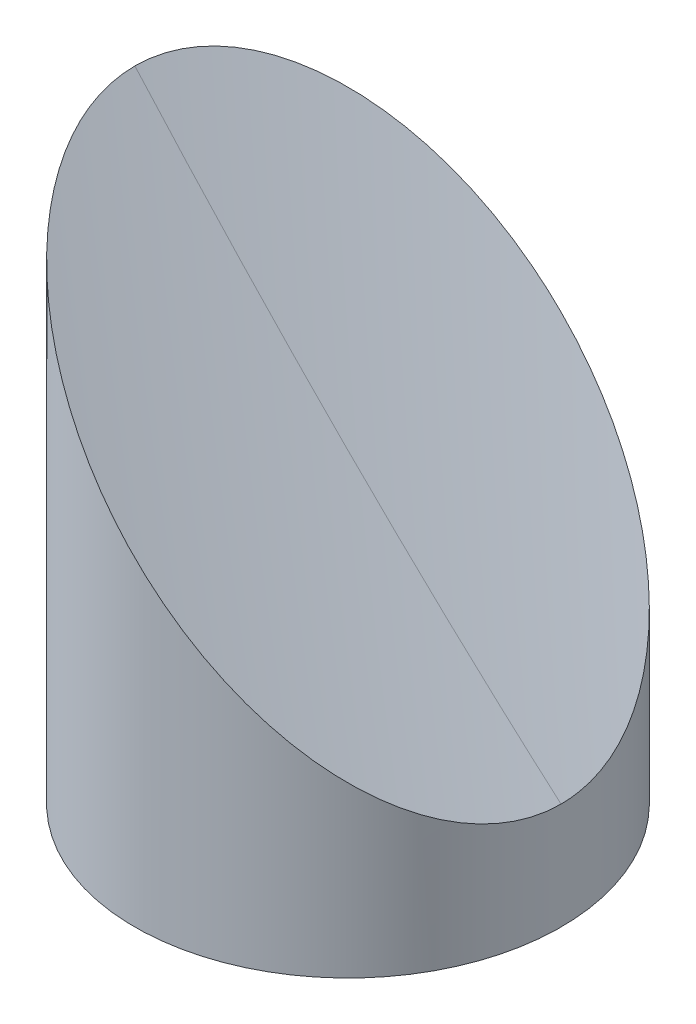
ISO-10303-21;
HEADER;
FILE_DESCRIPTION(('STEP AP214'),'2;1');
FILE_NAME('part.step','',(''),(''),'','','');
FILE_SCHEMA(('AUTOMOTIVE_DESIGN { 1 0 10303 214 1 1 1 1 }'));
ENDSEC;
DATA;
#1=APPLICATION_CONTEXT('core data for automotive mechanical design processes');
#2=APPLICATION_PROTOCOL_DEFINITION('international standard','automotive_design',2000,#1);
#3=PRODUCT_CONTEXT('',#1,'mechanical');
#4=PRODUCT('Part','Part','',(#3));
#5=PRODUCT_RELATED_PRODUCT_CATEGORY('part','',(#4));
#6=PRODUCT_DEFINITION_FORMATION('','',#4);
#7=PRODUCT_DEFINITION_CONTEXT('part definition',#1,'design');
#8=PRODUCT_DEFINITION('design','',#6,#7);
#9=PRODUCT_DEFINITION_SHAPE('','',#8);
#10=(LENGTH_UNIT() NAMED_UNIT(*) SI_UNIT(.MILLI.,.METRE.));
#11=(NAMED_UNIT(*) PLANE_ANGLE_UNIT() SI_UNIT($,.RADIAN.));
#12=(NAMED_UNIT(*) SI_UNIT($,.STERADIAN.) SOLID_ANGLE_UNIT());
#13=UNCERTAINTY_MEASURE_WITH_UNIT(LENGTH_MEASURE(1.E-05),#10,'distance_accuracy_value','');
#14=(GEOMETRIC_REPRESENTATION_CONTEXT(3) GLOBAL_UNCERTAINTY_ASSIGNED_CONTEXT((#13)) GLOBAL_UNIT_ASSIGNED_CONTEXT((#10,
#11,#12)) REPRESENTATION_CONTEXT('',''));
#15=CARTESIAN_POINT('',(0.,0.,0.));
#16=DIRECTION('',(0.,0.,1.));
#17=DIRECTION('',(1.,0.,0.));
#18=AXIS2_PLACEMENT_3D('',#15,#16,#17);
#19=CARTESIAN_POINT('',(9.525,4.32,0.));
#20=DIRECTION('',(0.,1.,0.));
#21=DIRECTION('',(0.,0.,1.));
#22=AXIS2_PLACEMENT_3D('',#19,#20,#21);
#23=PLANE('',#22);
#24=CARTESIAN_POINT('',(9.525,4.32,0.));
#25=DIRECTION('',(0.,-1.,0.));
#26=DIRECTION('',(0.,0.,-1.));
#27=AXIS2_PLACEMENT_3D('',#24,#25,#26);
#28=CIRCLE('',#27,1.594);
#29=CARTESIAN_POINT('',(9.525,4.32,-1.594));
#30=VERTEX_POINT('',#29);
#31=EDGE_CURVE('E19',#30,#30,#28,.T.);
#32=ORIENTED_EDGE('',*,*,#31,.T.);
#33=EDGE_LOOP('',(#32));
#34=FACE_BOUND('',#33,.T.);
#35=ADVANCED_FACE('F16',(#34),#23,.F.);
#36=CARTESIAN_POINT('',(0.,4.32,0.));
#37=DIRECTION('',(0.,1.,0.));
#38=DIRECTION('',(0.,0.,1.));
#39=AXIS2_PLACEMENT_3D('',#36,#37,#38);
#40=PLANE('',#39);
#41=CARTESIAN_POINT('',(0.,4.32,0.));
#42=DIRECTION('',(0.,-1.,0.));
#43=DIRECTION('',(0.,0.,-1.));
#44=AXIS2_PLACEMENT_3D('',#41,#42,#43);
#45=CIRCLE('',#44,1.594);
#46=CARTESIAN_POINT('',(0.,4.32,-1.594));
#47=VERTEX_POINT('',#46);
#48=EDGE_CURVE('E64',#47,#47,#45,.T.);
#49=ORIENTED_EDGE('',*,*,#48,.T.);
#50=EDGE_LOOP('',(#49));
#51=FACE_BOUND('',#50,.T.);
#52=ADVANCED_FACE('F128',(#51),#40,.F.);
#53=CARTESIAN_POINT('',(-9.525,6.1699999999405,0.));
#54=DIRECTION('',(0.,-1.,0.));
#55=DIRECTION('',(0.,0.,-1.));
#56=AXIS2_PLACEMENT_3D('',#53,#54,#55);
#57=CONICAL_SURFACE('',#56,1.35255000014922,1.02974425866422);
#58=CARTESIAN_POINT('',(-9.525,6.98269403028462,0.));
#59=VERTEX_POINT('',#58);
#60=VERTEX_LOOP('',#59);
#61=FACE_BOUND('',#60,.T.);
#62=CARTESIAN_POINT('',(-9.525,6.17,0.));
#63=DIRECTION('',(0.,-1.,0.));
#64=DIRECTION('',(0.,0.,-1.));
#65=AXIS2_PLACEMENT_3D('',#62,#63,#64);
#66=CIRCLE('',#65,1.35255);
#67=CARTESIAN_POINT('',(-9.525,6.17,-1.35255));
#68=VERTEX_POINT('',#67);
#69=EDGE_CURVE('E58',#68,#68,#66,.T.);
#70=ORIENTED_EDGE('',*,*,#69,.T.);
#71=EDGE_LOOP('',(#70));
#72=FACE_BOUND('',#71,.T.);
#73=ADVANCED_FACE('F125',(#61,#72),#57,.F.);
#74=CARTESIAN_POINT('',(4.76250000000001,6.17000000005419,8.24889197104677));
#75=DIRECTION('',(0.,-1.,0.));
#76=DIRECTION('',(0.,0.,-1.));
#77=AXIS2_PLACEMENT_3D('',#74,#75,#76);
#78=CONICAL_SURFACE('',#77,1.35254999986183,1.02974425844574);
#79=CARTESIAN_POINT('',(4.76250000000001,6.98269403039831,8.24889197113204));
#80=VERTEX_POINT('',#79);
#81=VERTEX_LOOP('',#80);
#82=FACE_BOUND('',#81,.T.);
#83=CARTESIAN_POINT('',(4.76250000000001,6.17,8.24889197104677));
#84=DIRECTION('',(0.,-1.,0.));
#85=DIRECTION('',(0.,0.,-1.));
#86=AXIS2_PLACEMENT_3D('',#83,#84,#85);
#87=CIRCLE('',#86,1.35255);
#88=CARTESIAN_POINT('',(4.76250000000001,6.17,6.89634197104677));
#89=VERTEX_POINT('',#88);
#90=EDGE_CURVE('E53',#89,#89,#87,.T.);
#91=ORIENTED_EDGE('',*,*,#90,.T.);
#92=EDGE_LOOP('',(#91));
#93=FACE_BOUND('',#92,.T.);
#94=ADVANCED_FACE('F47',(#82,#93),#78,.F.);
#95=CARTESIAN_POINT('',(4.76250000000001,6.16999999999734,-8.24889197104677));
#96=DIRECTION('',(0.,-1.,0.));
#97=DIRECTION('',(1.,0.,0.));
#98=AXIS2_PLACEMENT_3D('',#95,#96,#97);
#99=CONICAL_SURFACE('',#98,1.35254999992502,1.02974425866409);
#100=CARTESIAN_POINT('',(4.76250000000001,6.98269403019935,-8.24889197110362));
#101=VERTEX_POINT('',#100);
#102=VERTEX_LOOP('',#101);
#103=FACE_BOUND('',#102,.T.);
#104=CARTESIAN_POINT('',(4.76250000000001,6.17,-8.24889197104677));
#105=DIRECTION('',(0.,-1.,0.));
#106=DIRECTION('',(0.,0.,-1.));
#107=AXIS2_PLACEMENT_3D('',#104,#105,#106);
#108=CIRCLE('',#107,1.35255);
#109=CARTESIAN_POINT('',(4.76250000000001,6.17,-9.60144197104677));
#110=VERTEX_POINT('',#109);
#111=EDGE_CURVE('E51',#110,#110,#108,.T.);
#112=ORIENTED_EDGE('',*,*,#111,.T.);
#113=EDGE_LOOP('',(#112));
#114=FACE_BOUND('',#113,.T.);
#115=ADVANCED_FACE('F43',(#103,#114),#99,.F.);
#116=CARTESIAN_POINT('',(9.525,0.,0.));
#117=DIRECTION('',(0.,-1.,0.));
#118=DIRECTION('',(0.,0.,-1.));
#119=AXIS2_PLACEMENT_3D('',#116,#117,#118);
#120=CYLINDRICAL_SURFACE('',#119,1.594);
#121=ORIENTED_EDGE('',*,*,#31,.F.);
#122=EDGE_LOOP('',(#121));
#123=FACE_BOUND('',#122,.T.);
#124=CARTESIAN_POINT('',(9.525,0.,0.));
#125=DIRECTION('',(0.,-1.,0.));
#126=DIRECTION('',(0.,0.,-1.));
#127=AXIS2_PLACEMENT_3D('',#124,#125,#126);
#128=CIRCLE('',#127,1.594);
#129=CARTESIAN_POINT('',(9.525,0.,-1.594));
#130=VERTEX_POINT('',#129);
#131=EDGE_CURVE('E55',#130,#130,#128,.T.);
#132=ORIENTED_EDGE('',*,*,#131,.T.);
#133=EDGE_LOOP('',(#132));
#134=FACE_BOUND('',#133,.T.);
#135=ADVANCED_FACE('F46',(#123,#134),#120,.F.);
#136=CARTESIAN_POINT('',(0.,0.,0.));
#137=DIRECTION('',(0.,-1.,0.));
#138=DIRECTION('',(0.,0.,-1.));
#139=AXIS2_PLACEMENT_3D('',#136,#137,#138);
#140=CYLINDRICAL_SURFACE('',#139,1.594);
#141=ORIENTED_EDGE('',*,*,#48,.F.);
#142=EDGE_LOOP('',(#141));
#143=FACE_BOUND('',#142,.T.);
#144=CARTESIAN_POINT('',(0.,0.,0.));
#145=DIRECTION('',(0.,-1.,0.));
#146=DIRECTION('',(0.,0.,-1.));
#147=AXIS2_PLACEMENT_3D('',#144,#145,#146);
#148=CIRCLE('',#147,1.594);
#149=CARTESIAN_POINT('',(0.,0.,-1.594));
#150=VERTEX_POINT('',#149);
#151=EDGE_CURVE('E163',#150,#150,#148,.T.);
#152=ORIENTED_EDGE('',*,*,#151,.T.);
#153=EDGE_LOOP('',(#152));
#154=FACE_BOUND('',#153,.T.);
#155=ADVANCED_FACE('F115',(#143,#154),#140,.F.);
#156=CARTESIAN_POINT('',(-9.525,0.,0.));
#157=DIRECTION('',(0.,-1.,0.));
#158=DIRECTION('',(0.,0.,-1.));
#159=AXIS2_PLACEMENT_3D('',#156,#157,#158);
#160=CYLINDRICAL_SURFACE('',#159,1.35255);
#161=ORIENTED_EDGE('',*,*,#69,.F.);
#162=EDGE_LOOP('',(#161));
#163=FACE_BOUND('',#162,.T.);
#164=CARTESIAN_POINT('',(-9.525,0.,0.));
#165=DIRECTION('',(0.,-1.,0.));
#166=DIRECTION('',(0.,0.,-1.));
#167=AXIS2_PLACEMENT_3D('',#164,#165,#166);
#168=CIRCLE('',#167,1.35255);
#169=CARTESIAN_POINT('',(-9.525,0.,-1.35255));
#170=VERTEX_POINT('',#169);
#171=EDGE_CURVE('E159',#170,#170,#168,.T.);
#172=ORIENTED_EDGE('',*,*,#171,.T.);
#173=EDGE_LOOP('',(#172));
#174=FACE_BOUND('',#173,.T.);
#175=ADVANCED_FACE('F111',(#163,#174),#160,.F.);
#176=CARTESIAN_POINT('',(4.76250000000001,0.,8.24889197104677));
#177=DIRECTION('',(0.,-1.,0.));
#178=DIRECTION('',(0.,0.,-1.));
#179=AXIS2_PLACEMENT_3D('',#176,#177,#178);
#180=CYLINDRICAL_SURFACE('',#179,1.35255);
#181=ORIENTED_EDGE('',*,*,#90,.F.);
#182=EDGE_LOOP('',(#181));
#183=FACE_BOUND('',#182,.T.);
#184=CARTESIAN_POINT('',(4.76250000000001,0.,8.24889197104677));
#185=DIRECTION('',(0.,-1.,0.));
#186=DIRECTION('',(0.,0.,-1.));
#187=AXIS2_PLACEMENT_3D('',#184,#185,#186);
#188=CIRCLE('',#187,1.35255);
#189=CARTESIAN_POINT('',(4.76250000000001,0.,6.89634197104677));
#190=VERTEX_POINT('',#189);
#191=EDGE_CURVE('E155',#190,#190,#188,.T.);
#192=ORIENTED_EDGE('',*,*,#191,.T.);
#193=EDGE_LOOP('',(#192));
#194=FACE_BOUND('',#193,.T.);
#195=ADVANCED_FACE('F108',(#183,#194),#180,.F.);
#196=CARTESIAN_POINT('',(4.76250000000001,0.,-8.24889197104677));
#197=DIRECTION('',(0.,-1.,0.));
#198=DIRECTION('',(0.,0.,-1.));
#199=AXIS2_PLACEMENT_3D('',#196,#197,#198);
#200=CYLINDRICAL_SURFACE('',#199,1.35255);
#201=ORIENTED_EDGE('',*,*,#111,.F.);
#202=EDGE_LOOP('',(#201));
#203=FACE_BOUND('',#202,.T.);
#204=CARTESIAN_POINT('',(4.76250000000001,0.,-8.24889197104677));
#205=DIRECTION('',(0.,-1.,0.));
#206=DIRECTION('',(0.,0.,-1.));
#207=AXIS2_PLACEMENT_3D('',#204,#205,#206);
#208=CIRCLE('',#207,1.35255);
#209=CARTESIAN_POINT('',(4.76250000000001,0.,-9.60144197104677));
#210=VERTEX_POINT('',#209);
#211=EDGE_CURVE('E151',#210,#210,#208,.T.);
#212=ORIENTED_EDGE('',*,*,#211,.T.);
#213=EDGE_LOOP('',(#212));
#214=FACE_BOUND('',#213,.T.);
#215=ADVANCED_FACE('F100',(#203,#214),#200,.F.);
#216=CARTESIAN_POINT('',(-11.9042569174298,31.9215643001303,14.7022721414963));
#217=CARTESIAN_POINT('',(-11.9104415816003,31.9215643001303,14.65404295504));
#218=CARTESIAN_POINT('',(-11.9166262457707,31.9215643001303,14.6058137685837));
#219=CARTESIAN_POINT('',(-11.9228109099412,31.9215643001303,14.5575845821275));
#220=CARTESIAN_POINT('',(-12.5421165192495,31.9215643001303,9.72812175576746));
#221=CARTESIAN_POINT('',(-12.8524000000003,31.9215643001303,4.86900920402644));
#222=CARTESIAN_POINT('',(-12.8524000000002,31.9215643001303,-2.02789174341689E-12));
#223=CARTESIAN_POINT('',(0.841671622343238,17.4433357001202,13.0512846351499));
#224=CARTESIAN_POINT('',(0.836181463292676,17.4433357001202,13.0084713315935));
#225=CARTESIAN_POINT('',(0.830691304242113,17.4433357001202,12.9656580280371));
#226=CARTESIAN_POINT('',(0.825201145191551,17.4433357001202,12.9228447244807));
#227=CARTESIAN_POINT('',(0.275440284731419,17.4433357001202,8.63570506503994));
#228=CARTESIAN_POINT('',(-7.72457180097907E-13,17.4433357001202,4.32224518777315));
#229=CARTESIAN_POINT('',(-6.95190432997705E-13,17.4433357001202,-1.81625547934772E-12));
#230=CARTESIAN_POINT('',(13.5876001621163,6.21676430011232,11.4002971288035));
#231=CARTESIAN_POINT('',(13.5828045081856,6.21676430011232,11.362899708147));
#232=CARTESIAN_POINT('',(13.578008854255,6.21676430011232,11.3255022874905));
#233=CARTESIAN_POINT('',(13.5732132003243,6.21676430011232,11.288104866834));
#234=CARTESIAN_POINT('',(13.0929970887124,6.21676430011232,7.54328837431242));
#235=CARTESIAN_POINT('',(12.8523999999988,6.21676430011232,3.77548117151985));
#236=CARTESIAN_POINT('',(12.8523999999989,6.21676430011232,-1.60114976832659E-12));
#237=(BOUNDED_SURFACE() B_SPLINE_SURFACE(2,3,((#216,#217,#218,#219,#220,#221,#222),(#223,#224,
#225,#226,#227,#228,#229),(#230,#231,#232,#233,#234,#235,#236)),.UNSPECIFIED.,.F.,.F.,
.F.) B_SPLINE_SURFACE_WITH_KNOTS((3,3),(4,3,4),(0.495985485262823,0.496887102864692),(-0.01,0.,
1.),.UNSPECIFIED.) GEOMETRIC_REPRESENTATION_ITEM() RATIONAL_B_SPLINE_SURFACE(((1.,1.,1.,1.,
0.998644946453135,0.998644946453135,1.),(1.,1.,1.,1.,0.998644946453135,0.998644946453135,1.),
(1.,1.,1.,1.,0.998644946453135,0.998644946453135,1.))) REPRESENTATION_ITEM('') SURFACE());
#238=CARTESIAN_POINT('',(12.7000000000009,6.35000000011088,-3.20601156601669E-13));
#239=CARTESIAN_POINT('',(12.7000017011059,6.34999829935566,0.135684319521362));
#240=CARTESIAN_POINT('',(12.6978249686449,6.3521750316979,0.271349485595696));
#241=CARTESIAN_POINT('',(12.6891366451383,6.36086335473468,0.542394958743594));
#242=CARTESIAN_POINT('',(12.682625280804,6.36737471871792,0.677775280343717));
#243=CARTESIAN_POINT('',(12.6566372267064,6.39336277247183,1.08290166059956));
#244=CARTESIAN_POINT('',(12.6307064947287,6.4192935051641,1.35187379328673));
#245=CARTESIAN_POINT('',(12.562395730471,6.48760426985753,1.88349381225184));
#246=CARTESIAN_POINT('',(12.5201386476156,6.52986135244139,2.14617374180435));
#247=CARTESIAN_POINT('',(12.4199443961728,6.63005560375178,2.66550556706148));
#248=CARTESIAN_POINT('',(12.3620053417756,6.68799465828812,2.92215673375052));
#249=CARTESIAN_POINT('',(12.2316136459631,6.81838635419561,3.42716649719821));
#250=CARTESIAN_POINT('',(12.1592002672148,6.89079973290016,3.67554545139226));
#251=CARTESIAN_POINT('',(12.0008408041093,7.0491591959798,4.16361365219873));
#252=CARTESIAN_POINT('',(11.914889154533,7.1351108455739,4.40329927514667));
#253=CARTESIAN_POINT('',(11.730500305167,7.31949969495019,4.87331419404019));
#254=CARTESIAN_POINT('',(11.6320443778915,7.4179556222182,5.10362875746669));
#255=CARTESIAN_POINT('',(11.4239093497682,7.6260906503383,5.55390368303818));
#256=CARTESIAN_POINT('',(11.3142277619281,7.73577223818273,5.77386173491895));
#257=CARTESIAN_POINT('',(11.0342510430305,8.01574895708361,6.29746576760331));
#258=CARTESIAN_POINT('',(10.8585266090112,8.19147339109869,6.59533128150971));
#259=CARTESIAN_POINT('',(10.489261607941,8.56073839216909,7.16809628243459));
#260=CARTESIAN_POINT('',(10.2957146646945,8.75428533541997,7.44298748252397));
#261=CARTESIAN_POINT('',(9.89325545716109,9.15674454295102,7.97017201462192));
#262=CARTESIAN_POINT('',(9.68431845608248,9.36568154402278,8.22242745387781));
#263=CARTESIAN_POINT('',(9.25376422005247,9.79623578005379,8.70415000741975));
#264=CARTESIAN_POINT('',(9.03214676471864,10.0178532353955,8.93361672545504));
#265=CARTESIAN_POINT('',(8.4906898777814,10.5593101223335,9.45455770225756));
#266=CARTESIAN_POINT('',(8.16592622150038,10.8840737786006,9.73582571165397));
#267=CARTESIAN_POINT('',(7.50032715987881,11.5496728402249,10.2573857624519));
#268=CARTESIAN_POINT('',(7.15948560868808,11.8905143914324,10.4976619698433));
#269=CARTESIAN_POINT('',(6.46518056264276,12.5848194374681,10.9389532419128));
#270=CARTESIAN_POINT('',(6.11171110166918,12.9382888984152,11.139949450478));
#271=CARTESIAN_POINT('',(5.39523454202005,13.6547654580639,11.5040387573262));
#272=CARTESIAN_POINT('',(5.0322283645828,14.0177716355272,11.667135501788));
#273=CARTESIAN_POINT('',(4.28669922301035,14.7633007771143,11.961613168183));
#274=CARTESIAN_POINT('',(3.90393028813392,15.1460697119781,12.0917445377864));
#275=CARTESIAN_POINT('',(3.13294073118036,15.9170592689286,12.3140426090707));
#276=CARTESIAN_POINT('',(2.74471999432281,16.3052800057956,12.4062085101964));
#277=CARTESIAN_POINT('',(1.96461579671128,17.0853842034081,12.5534019921638));
#278=CARTESIAN_POINT('',(1.57273084382577,17.4772691562851,12.6084137100659));
#279=CARTESIAN_POINT('',(0.787240611464773,18.2627593886525,12.6817135085022));
#280=CARTESIAN_POINT('',(0.393635201145898,18.6563647989863,12.6999987454607));
#281=CARTESIAN_POINT('',(-0.488910704368799,19.5389107044751,12.700001558188));
#282=CARTESIAN_POINT('',(-0.97786736596312,20.0278673660143,12.6717970820782));
#283=CARTESIAN_POINT('',(-1.95261147377415,21.0026114738341,12.5585872548685));
#284=CARTESIAN_POINT('',(-2.43839806163574,21.4883980617597,12.4735671157916));
#285=CARTESIAN_POINT('',(-3.40301609320125,22.4530160933228,12.2456133050635));
#286=CARTESIAN_POINT('',(-3.88184960111995,22.9318496011753,12.1026972012512));
#287=CARTESIAN_POINT('',(-4.82852880763377,23.878528807685,11.7570871237948));
#288=CARTESIAN_POINT('',(-5.29637916797907,24.3463791680924,11.5544190256656));
#289=CARTESIAN_POINT('',(-6.07820209930239,25.1282020994352,11.1568751475928));
#290=CARTESIAN_POINT('',(-6.39624295533773,25.4462429554537,10.977891497469));
#291=CARTESIAN_POINT('',(-7.02251406232717,26.0725140624383,10.5882152467289));
#292=CARTESIAN_POINT('',(-7.33074470836979,26.380744708493,10.3775239250445));
#293=CARTESIAN_POINT('',(-7.93448131571324,26.9844813158424,9.92353207290761));
#294=CARTESIAN_POINT('',(-8.23000339458807,27.2800033947112,9.68027455862191));
#295=CARTESIAN_POINT('',(-8.80567016334823,27.8556701634708,9.15973145153672));
#296=CARTESIAN_POINT('',(-9.08581930748571,28.1358193076136,8.88245579152338));
#297=CARTESIAN_POINT('',(-9.55687233925788,28.6068723393852,8.36923408011817));
#298=CARTESIAN_POINT('',(-9.75209276754787,28.8020927676718,8.14119328334629));
#299=CARTESIAN_POINT('',(-10.1302585965242,29.1802585966486,7.66551745095542));
#300=CARTESIAN_POINT('',(-10.313204582359,29.3632045824872,7.41788335061869));
#301=CARTESIAN_POINT('',(-10.6645907690614,29.7145907691896,6.90315370176055));
#302=CARTESIAN_POINT('',(-10.8330427331082,29.8830427332325,6.63607426617604));
#303=CARTESIAN_POINT('',(-11.1532332972313,30.2032332973573,6.08256034394239));
#304=CARTESIAN_POINT('',(-11.3049757465948,30.3549757467265,5.79613033962141));
#305=CARTESIAN_POINT('',(-11.5604367059038,30.61043670603,5.26448896252156));
#306=CARTESIAN_POINT('',(-11.6676635062457,30.717663506364,5.02264366231652));
#307=CARTESIAN_POINT('',(-11.8684313393865,30.9184313395064,4.52786624209102));
#308=CARTESIAN_POINT('',(-11.9619755017782,31.0119755019077,4.27493667459975));
#309=CARTESIAN_POINT('',(-12.1338392171312,31.1838392172605,3.75947140966234));
#310=CARTESIAN_POINT('',(-12.2121860834215,31.2621860835411,3.49695397264327));
#311=CARTESIAN_POINT('',(-12.3525206131992,31.40252061332,2.96332349313445));
#312=CARTESIAN_POINT('',(-12.4145121818287,31.4645121819603,2.69221251986553));
#313=CARTESIAN_POINT('',(-12.5058242477374,31.5558242478664,2.22135360234098));
#314=CARTESIAN_POINT('',(-12.5394220647083,31.5894220648298,2.02324625351324));
#315=CARTESIAN_POINT('',(-12.5973040144486,31.6473040145747,1.6243559762014));
#316=CARTESIAN_POINT('',(-12.6215901722825,31.6715901724206,1.42357363930305));
#317=CARTESIAN_POINT('',(-12.6606434397059,31.7106434398274,1.01951125328983));
#318=CARTESIAN_POINT('',(-12.6753799408536,31.7253799409465,0.816225280215198));
#319=CARTESIAN_POINT('',(-12.6950699881427,31.745069988211,0.408630021815804));
#320=CARTESIAN_POINT('',(-12.7000197234413,31.7500197235136,0.204320368915214));
#321=CARTESIAN_POINT('',(-12.7000000000009,31.7500000001303,-1.40270163050893E-12));
#322=B_SPLINE_CURVE_WITH_KNOTS('',3,(#238,#239,#240,#241,#242,#243,#244,#245,#246,#247,#248,
#249,#250,#251,#252,#253,#254,#255,#256,#257,#258,#259,#260,#261,#262,#263,#264,#265,#266,#267,
#268,#269,#270,#271,#272,#273,#274,#275,#276,#277,#278,#279,#280,#281,#282,#283,#284,#285,#286,
#287,#288,#289,#290,#291,#292,#293,#294,#295,#296,#297,#298,#299,#300,#301,#302,#303,#304,#305,
#306,#307,#308,#309,#310,#311,#312,#313,#314,#315,#316,#317,#318,#319,#320,#321),.UNSPECIFIED.,
.F.,.F.,(4,2,2,2,2,2,2,2,2,2,2,2,2,2,2,2,2,2,2,2,2,2,2,2,2,2,2,2,2,2,2,2,2,2,2,2,2,2,2,2,2,4),
(0.,0.406980210486731,0.813939136634626,1.62713767850358,2.43432798930616,3.24161541061467,
4.04674201842906,4.85220046007494,5.65887977448911,6.46573819336654,7.62775582417659,
8.79019080661503,9.95453677771702,11.1189029909478,12.7322240661404,14.3461669189736,
15.9608826418557,17.5754429540473,19.2442438284951,20.9130798901507,22.5826280099535,
24.2523053908099,26.3261116509239,28.4004578915348,30.4741751674604,32.5469957388495,
33.9981578300756,35.4492614042227,36.8984668098451,38.3472500718956,39.420661205825,
40.4940211315747,41.5665015483256,42.6387343839919,43.4943078928907,44.3496854017353,
45.2035110429609,46.0571326320114,46.6679031294058,47.2785407232969,47.8911259695515,
48.5039497018096),.UNSPECIFIED.);
#323=CARTESIAN_POINT('',(12.7000000000002,6.35000000011157,-1.60300578300834E-13));
#324=VERTEX_POINT('',#323);
#325=CARTESIAN_POINT('',(-12.7000000000001,31.7500000001303,-5.92354980808534E-13));
#326=VERTEX_POINT('',#325);
#327=EDGE_CURVE('E73',#324,#326,#322,.T.);
#328=CARTESIAN_POINT('',(-12.8523999999999,31.9215643001303,0.));
#329=CARTESIAN_POINT('',(-3.20923843055709E-13,17.4433357001202,0.));
#330=CARTESIAN_POINT('',(12.8523999999992,6.21676430011232,0.));
#331=B_SPLINE_CURVE_WITH_KNOTS('',2,(#328,#329,#330),.UNSPECIFIED.,.F.,.F.,(3,3),
(0.495985485262823,0.496887102864692),.UNSPECIFIED.);
#332=EDGE_CURVE('E31',#326,#324,#331,.T.);
#333=ORIENTED_EDGE('',*,*,#327,.F.);
#334=ORIENTED_EDGE('',*,*,#332,.F.);
#335=EDGE_LOOP('',(#333,#334));
#336=FACE_BOUND('',#335,.T.);
#337=ADVANCED_FACE('F88',(#336),#237,.T.);
#338=CARTESIAN_POINT('',(-12.8523999999999,31.9215643001303,0.));
#339=CARTESIAN_POINT('',(-12.8523999999999,31.9215643001303,-4.84248926879229));
#340=CARTESIAN_POINT('',(-12.5454828273823,31.9215643001303,-9.67524253867076));
#341=CARTESIAN_POINT('',(-11.9328826181849,31.9215643001303,-14.47882696096));
#342=CARTESIAN_POINT('',(-11.9206779098892,31.9215643001303,-14.5745277879714));
#343=CARTESIAN_POINT('',(-11.9084732015936,31.9215643001303,-14.6702286149828));
#344=CARTESIAN_POINT('',(-11.8962684932979,31.9215643001303,-14.7659294419943));
#345=CARTESIAN_POINT('',(-3.20923843055709E-13,17.4433357001202,0.));
#346=CARTESIAN_POINT('',(-3.20923843055709E-13,17.4433357001202,-4.29870330119158));
#347=CARTESIAN_POINT('',(0.272451995221636,17.4433357001202,-8.5887639047233));
#348=CARTESIAN_POINT('',(0.816260436586435,17.4433357001202,-12.8529311681847));
#349=CARTESIAN_POINT('',(0.827094620603878,17.4433357001202,-12.9378852977998));
#350=CARTESIAN_POINT('',(0.837928804621321,17.4433357001202,-13.0228394274149));
#351=CARTESIAN_POINT('',(0.848762988638764,17.4433357001202,-13.10779355703));
#352=CARTESIAN_POINT('',(12.8523999999992,6.21676430011232,0.));
#353=CARTESIAN_POINT('',(12.8523999999992,6.21676430011232,-3.75491733359087));
#354=CARTESIAN_POINT('',(13.0903868178256,6.21676430011232,-7.50228527077585));
#355=CARTESIAN_POINT('',(13.5654034913578,6.21676430011232,-11.2270353754094));
#356=CARTESIAN_POINT('',(13.574867151097,6.21676430011232,-11.3012428076282));
#357=CARTESIAN_POINT('',(13.5843308108362,6.21676430011232,-11.375450239847));
#358=CARTESIAN_POINT('',(13.5937944705755,6.21676430011232,-11.4496576720658));
#359=(BOUNDED_SURFACE() B_SPLINE_SURFACE(2,3,((#338,#339,#340,#341,#342,#343,#344),(#345,#346,
#347,#348,#349,#350,#351),(#352,#353,#354,#355,#356,#357,#358)),.UNSPECIFIED.,.F.,.F.,
.F.) B_SPLINE_SURFACE_WITH_KNOTS((3,3),(4,3,4),(0.495985485262823,0.496887102864692),(0.,1.,
1.0199495343589),.UNSPECIFIED.) GEOMETRIC_REPRESENTATION_ITEM() RATIONAL_B_SPLINE_SURFACE(((1.,
0.998659642679152,0.998659642679152,1.,1.,1.,1.),(1.,0.998659642679152,0.998659642679152,1.,1.,
1.,1.),(1.,0.998659642679152,0.998659642679152,1.,1.,1.,1.))) REPRESENTATION_ITEM('') SURFACE());
#360=CARTESIAN_POINT('',(-12.7000000000001,31.7500000001303,-1.18470996161707E-12));
#361=CARTESIAN_POINT('',(-12.7000020706973,31.7500020712126,-0.142407966182025));
#362=CARTESIAN_POINT('',(-12.697604004288,31.7476040046724,-0.284793781596062));
#363=CARTESIAN_POINT('',(-12.6880342807497,31.738034280617,-0.569237167313818));
#364=CARTESIAN_POINT('',(-12.6808628658714,31.7308628653524,-0.711294753908249));
#365=CARTESIAN_POINT('',(-12.6522480771669,31.7022480762701,-1.13627656483549));
#366=CARTESIAN_POINT('',(-12.6237040430101,31.6737040429006,-1.41830675208731));
#367=CARTESIAN_POINT('',(-12.5486147844175,31.5986147847854,-1.97497626478405));
#368=CARTESIAN_POINT('',(-12.5022246147493,31.5522246148167,-2.24965803339331));
#369=CARTESIAN_POINT('',(-12.3923608421926,31.4423608421134,-2.7921288453924));
#370=CARTESIAN_POINT('',(-12.3288847953058,31.3788847953805,-3.05991689668227));
#371=CARTESIAN_POINT('',(-12.1862353098602,31.2362353100459,-3.58605081037256));
#372=CARTESIAN_POINT('',(-12.1071087717103,31.1571087718538,-3.84442221671448));
#373=CARTESIAN_POINT('',(-11.9343428331566,30.9843428332701,-4.3512232569645));
#374=CARTESIAN_POINT('',(-11.8407039347588,30.8907039348846,-4.59965323438897));
#375=CARTESIAN_POINT('',(-11.6400731605222,30.6900731606556,-5.08606342751056));
#376=CARTESIAN_POINT('',(-11.5330571078635,30.5830571079924,-5.32402364062429));
#377=CARTESIAN_POINT('',(-11.3070954591736,30.3570954593008,-5.7884662134712));
#378=CARTESIAN_POINT('',(-11.1881433915308,30.2381433916609,-6.01494224530886));
#379=CARTESIAN_POINT('',(-10.8889412677947,29.9389412679227,-6.54582856159079));
#380=CARTESIAN_POINT('',(-10.7034696633845,29.7534696635037,-6.84437539165553));
#381=CARTESIAN_POINT('',(-10.3147078578342,29.3647078579533,-7.41732905639198));
#382=CARTESIAN_POINT('',(-10.1114102147429,29.1614102148708,-7.69172571222634));
#383=CARTESIAN_POINT('',(-9.68954881388924,28.7395488140179,-8.21682613202465));
#384=CARTESIAN_POINT('',(-9.47096222662457,28.5209622267452,-8.46749309022217));
#385=CARTESIAN_POINT('',(-9.02125194897078,28.0712519490911,-8.94508899530728));
#386=CARTESIAN_POINT('',(-8.79012803565353,27.8401280357814,-9.1720175198879));
#387=CARTESIAN_POINT('',(-8.22599944537949,27.2759994455059,-9.6860495605833));
#388=CARTESIAN_POINT('',(-7.88813662108178,26.9381366211915,-9.96252218869896));
#389=CARTESIAN_POINT('',(-7.19668929677887,26.2466892968906,-10.4729378522591));
#390=CARTESIAN_POINT('',(-6.84309864562787,25.8930986457582,-10.7068640625298));
#391=CARTESIAN_POINT('',(-6.1237599315475,25.1737599316687,-11.1339367158236));
#392=CARTESIAN_POINT('',(-5.75800879094291,24.8080087910364,-11.3270727429939));
#393=CARTESIAN_POINT('',(-5.01740027549825,24.0674002755894,-11.6740263493355));
#394=CARTESIAN_POINT('',(-4.64254421214081,23.6925442122574,-11.8278495548188));
#395=CARTESIAN_POINT('',(-3.91632884067259,22.9663288408036,-12.0867218179516));
#396=CARTESIAN_POINT('',(-3.56548506918593,22.6154850693086,-12.1946858164639));
#397=CARTESIAN_POINT('',(-2.85972611052249,21.9097261106413,-12.3792162199813));
#398=CARTESIAN_POINT('',(-2.5048111692217,21.5548111693448,-12.4557845109561));
#399=CARTESIAN_POINT('',(-1.79223994422208,20.8422399443441,-12.5780995611692));
#400=CARTESIAN_POINT('',(-1.43458291272983,20.4845829128464,-12.6238375866997));
#401=CARTESIAN_POINT('',(-0.717961915989986,19.7679619161117,-12.6847884281869));
#402=CARTESIAN_POINT('',(-0.35899783981466,19.4089978399471,-12.6999985897822));
#403=CARTESIAN_POINT('',(0.488809009672394,18.5611909904331,-12.7000019201429));
#404=CARTESIAN_POINT('',(0.97768061497108,18.0723193850781,-12.6718077888526));
#405=CARTESIAN_POINT('',(1.95226940281252,17.097730597245,-12.5586379647076));
#406=CARTESIAN_POINT('',(2.43798557665861,16.6120144234636,-12.4736449376789));
#407=CARTESIAN_POINT('',(3.40262032182935,15.6473796782862,-12.2457264689546));
#408=CARTESIAN_POINT('',(3.88153881493867,15.1684611851054,-12.1028003612289));
#409=CARTESIAN_POINT('',(4.82837901879201,14.2216209812469,-11.757152098755));
#410=CARTESIAN_POINT('',(5.29630551375635,13.7536944863487,-11.5544564993004));
#411=CARTESIAN_POINT('',(6.07821250123227,12.9717874988928,-11.1568698431989));
#412=CARTESIAN_POINT('',(6.39626354357753,12.6537364565291,-10.9778799077133));
#413=CARTESIAN_POINT('',(7.02255502287238,12.0274449772281,-10.5881885397784));
#414=CARTESIAN_POINT('',(7.33079583244478,11.719204167668,-10.3774883135293));
#415=CARTESIAN_POINT('',(7.93453120943844,11.1154687906797,-9.92349172504091));
#416=CARTESIAN_POINT('',(8.23004273124241,10.8199572688687,-9.68024061170318));
#417=CARTESIAN_POINT('',(8.8056891273959,10.2443108727136,-9.15971268112762));
#418=CARTESIAN_POINT('',(9.08582846425743,9.9641715358573,-8.88244581502886));
#419=CARTESIAN_POINT('',(9.55687106400445,9.49312893610889,-8.36923546953826));
#420=CARTESIAN_POINT('',(9.75209028541528,9.29790971469413,-8.14119618260562));
#421=CARTESIAN_POINT('',(10.1302538959311,8.91974610417848,-7.66552358642861));
#422=CARTESIAN_POINT('',(10.3131988683084,8.73680113180534,-7.41789120946821));
#423=CARTESIAN_POINT('',(10.6645854324005,8.38541456771239,-6.90316203017519));
#424=CARTESIAN_POINT('',(10.8330386078872,8.21696139222078,-6.6360810950676));
#425=CARTESIAN_POINT('',(11.153231394769,7.89676860534078,-6.08256393489871));
#426=CARTESIAN_POINT('',(11.3049748560503,7.7450251440663,-5.79613219286802));
#427=CARTESIAN_POINT('',(11.5604368362769,7.48956316383247,-5.2644886912539));
#428=CARTESIAN_POINT('',(11.6676637526465,7.38233624745281,-5.0226431066004));
#429=CARTESIAN_POINT('',(11.8684317846666,7.18156821543425,-4.52786509324199));
#430=CARTESIAN_POINT('',(11.9619760299604,7.088023970152,-4.2749352171072));
#431=CARTESIAN_POINT('',(12.133839676161,6.916160323951,-3.7594699064659));
#432=CARTESIAN_POINT('',(12.2121864249035,6.83781357519647,-3.49695275544584));
#433=CARTESIAN_POINT('',(12.3525207557615,6.69747924433915,-2.96332286979035));
#434=CARTESIAN_POINT('',(12.4145122430189,6.63548775709456,-2.69221220437507));
#435=CARTESIAN_POINT('',(12.5058242340557,6.54417576605435,-2.2213536728631));
#436=CARTESIAN_POINT('',(12.5394220405848,6.51057795951636,-2.02324639574675));
#437=CARTESIAN_POINT('',(12.5973039762662,6.45269602384115,-1.62435626333636));
#438=CARTESIAN_POINT('',(12.6215901304714,6.42840986965106,-1.42357399962475));
#439=CARTESIAN_POINT('',(12.6606434116318,6.38935658846923,-1.01951161620168));
#440=CARTESIAN_POINT('',(12.6753799232764,6.374620076788,-0.816225571198621));
#441=CARTESIAN_POINT('',(12.6950699846214,6.3549300154114,-0.408630167846754));
#442=CARTESIAN_POINT('',(12.7000197234738,6.34998027656426,-0.20432044192146));
#443=CARTESIAN_POINT('',(12.6999999999988,6.35000000011226,-5.88638986822689E-13));
#444=B_SPLINE_CURVE_WITH_KNOTS('',3,(#360,#361,#362,#363,#364,#365,#366,#367,#368,#369,#370,
#371,#372,#373,#374,#375,#376,#377,#378,#379,#380,#381,#382,#383,#384,#385,#386,#387,#388,#389,
#390,#391,#392,#393,#394,#395,#396,#397,#398,#399,#400,#401,#402,#403,#404,#405,#406,#407,#408,
#409,#410,#411,#412,#413,#414,#415,#416,#417,#418,#419,#420,#421,#422,#423,#424,#425,#426,#427,
#428,#429,#430,#431,#432,#433,#434,#435,#436,#437,#438,#439,#440,#441,#442,#443),.UNSPECIFIED.,
.F.,.F.,(4,2,2,2,2,2,2,2,2,2,2,2,2,2,2,2,2,2,2,2,2,2,2,2,2,2,2,2,2,2,2,2,2,2,2,2,2,2,2,2,2,4),
(0.,0.427139825264932,0.85425797454775,1.70760715652181,2.55370368547095,3.39992130614406,
4.24364044174759,5.08733039824223,5.93256783897638,6.77826606268116,7.96869652472962,
9.15962635141554,10.3523740920549,11.5451430480817,13.198807769737,14.8531250254489,
16.5078642049149,18.1623664311718,19.6846810872285,21.2069042830144,22.7295585186024,
24.2523451414275,26.3257610188825,28.3998099610138,30.473882748208,32.5470354198779,
33.9982444749459,35.4493983426867,36.8985555240282,38.3472897680776,39.4206940818134,
40.4940473512011,41.5665345237401,42.6387740779974,43.4943485693187,44.3497270576602,
45.2035517181449,46.057172326242,46.6679426044798,47.2785799799247,47.8911654448489,
48.5039893960339),.UNSPECIFIED.);
#445=EDGE_CURVE('E25',#326,#324,#444,.T.);
#446=ORIENTED_EDGE('',*,*,#332,.T.);
#447=ORIENTED_EDGE('',*,*,#445,.F.);
#448=EDGE_LOOP('',(#446,#447));
#449=FACE_BOUND('',#448,.T.);
#450=ADVANCED_FACE('F82',(#449),#359,.T.);
#451=CARTESIAN_POINT('',(0.,0.,0.));
#452=DIRECTION('',(0.,1.,0.));
#453=DIRECTION('',(0.,0.,1.));
#454=AXIS2_PLACEMENT_3D('',#451,#452,#453);
#455=PLANE('',#454);
#456=CARTESIAN_POINT('',(0.,0.,0.));
#457=DIRECTION('',(0.,-1.,0.));
#458=DIRECTION('',(0.,0.,-1.));
#459=AXIS2_PLACEMENT_3D('',#456,#457,#458);
#460=CIRCLE('',#459,12.7);
#461=CARTESIAN_POINT('',(0.,0.,-12.7));
#462=VERTEX_POINT('',#461);
#463=EDGE_CURVE('E9',#462,#462,#460,.F.);
#464=ORIENTED_EDGE('',*,*,#463,.F.);
#465=EDGE_LOOP('',(#464));
#466=FACE_BOUND('',#465,.T.);
#467=ORIENTED_EDGE('',*,*,#211,.F.);
#468=EDGE_LOOP('',(#467));
#469=FACE_BOUND('',#468,.T.);
#470=ORIENTED_EDGE('',*,*,#191,.F.);
#471=EDGE_LOOP('',(#470));
#472=FACE_BOUND('',#471,.T.);
#473=ORIENTED_EDGE('',*,*,#171,.F.);
#474=EDGE_LOOP('',(#473));
#475=FACE_BOUND('',#474,.T.);
#476=ORIENTED_EDGE('',*,*,#151,.F.);
#477=EDGE_LOOP('',(#476));
#478=FACE_BOUND('',#477,.T.);
#479=ORIENTED_EDGE('',*,*,#131,.F.);
#480=EDGE_LOOP('',(#479));
#481=FACE_BOUND('',#480,.T.);
#482=ADVANCED_FACE('F87',(#466,#469,#472,#475,#478,#481),#455,.F.);
#483=CARTESIAN_POINT('',(0.,200.,0.));
#484=DIRECTION('',(0.,-1.,0.));
#485=DIRECTION('',(0.,0.,-1.));
#486=AXIS2_PLACEMENT_3D('',#483,#484,#485);
#487=CYLINDRICAL_SURFACE('',#486,12.7);
#488=ORIENTED_EDGE('',*,*,#445,.T.);
#489=ORIENTED_EDGE('',*,*,#327,.T.);
#490=EDGE_LOOP('',(#488,#489));
#491=FACE_BOUND('',#490,.T.);
#492=ORIENTED_EDGE('',*,*,#463,.T.);
#493=EDGE_LOOP('',(#492));
#494=FACE_BOUND('',#493,.T.);
#495=ADVANCED_FACE('F79',(#491,#494),#487,.T.);
#496=CLOSED_SHELL('',(#35,#52,#73,#94,#115,#135,#155,#175,#195,#215,#337,#450,#482,#495));
#497=MANIFOLD_SOLID_BREP('B1',#496);
#498=ADVANCED_BREP_SHAPE_REPRESENTATION('',(#18,#497),#14);
#499=SHAPE_DEFINITION_REPRESENTATION(#9,#498);
ENDSEC;
END-ISO-10303-21;
